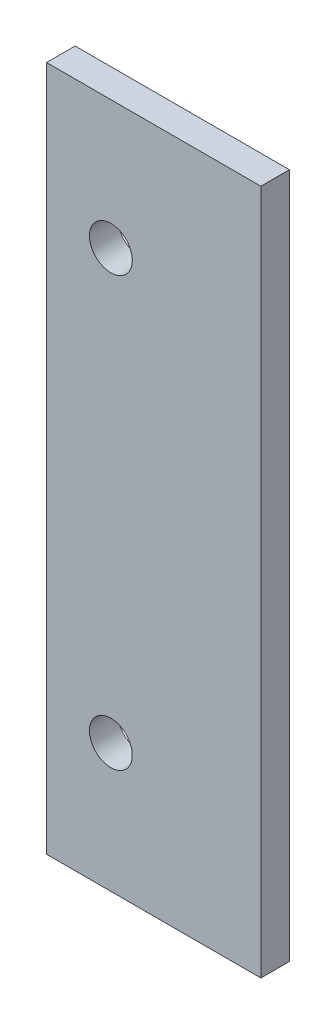
ISO-10303-21;
HEADER;
FILE_DESCRIPTION(('STEP AP214'),'2;1');
FILE_NAME('part.step','',(''),(''),'','','');
FILE_SCHEMA(('AUTOMOTIVE_DESIGN { 1 0 10303 214 1 1 1 1 }'));
ENDSEC;
DATA;
#1=APPLICATION_CONTEXT('core data for automotive mechanical design processes');
#2=APPLICATION_PROTOCOL_DEFINITION('international standard','automotive_design',2000,#1);
#3=PRODUCT_CONTEXT('',#1,'mechanical');
#4=PRODUCT('Part','Part','',(#3));
#5=PRODUCT_RELATED_PRODUCT_CATEGORY('part','',(#4));
#6=PRODUCT_DEFINITION_FORMATION('','',#4);
#7=PRODUCT_DEFINITION_CONTEXT('part definition',#1,'design');
#8=PRODUCT_DEFINITION('design','',#6,#7);
#9=PRODUCT_DEFINITION_SHAPE('','',#8);
#10=(LENGTH_UNIT() NAMED_UNIT(*) SI_UNIT(.MILLI.,.METRE.));
#11=(NAMED_UNIT(*) PLANE_ANGLE_UNIT() SI_UNIT($,.RADIAN.));
#12=(NAMED_UNIT(*) SI_UNIT($,.STERADIAN.) SOLID_ANGLE_UNIT());
#13=UNCERTAINTY_MEASURE_WITH_UNIT(LENGTH_MEASURE(1.E-05),#10,'distance_accuracy_value','');
#14=(GEOMETRIC_REPRESENTATION_CONTEXT(3) GLOBAL_UNCERTAINTY_ASSIGNED_CONTEXT((#13)) GLOBAL_UNIT_ASSIGNED_CONTEXT((#10,
#11,#12)) REPRESENTATION_CONTEXT('',''));
#15=CARTESIAN_POINT('',(0.,0.,0.));
#16=DIRECTION('',(0.,0.,1.));
#17=DIRECTION('',(1.,0.,0.));
#18=AXIS2_PLACEMENT_3D('',#15,#16,#17);
#19=CARTESIAN_POINT('',(0.,0.,2.));
#20=DIRECTION('',(0.,0.,-1.));
#21=DIRECTION('',(-1.,0.,0.));
#22=AXIS2_PLACEMENT_3D('',#19,#20,#21);
#23=PLANE('',#22);
#24=CARTESIAN_POINT('',(4.5,-9.,2.));
#25=DIRECTION('',(0.,0.,1.));
#26=DIRECTION('',(1.,0.,0.));
#27=AXIS2_PLACEMENT_3D('',#24,#25,#26);
#28=CIRCLE('',#27,1.5);
#29=CARTESIAN_POINT('',(6.,-9.,2.));
#30=VERTEX_POINT('',#29);
#31=EDGE_CURVE('E98',#30,#30,#28,.T.);
#32=ORIENTED_EDGE('',*,*,#31,.F.);
#33=EDGE_LOOP('',(#32));
#34=FACE_BOUND('',#33,.T.);
#35=DIRECTION('',(0.,-1.,0.));
#36=VECTOR('',#35,1.);
#37=CARTESIAN_POINT('',(0.,-48.,2.));
#38=LINE('',#37,#36);
#39=CARTESIAN_POINT('',(0.,0.,2.));
#40=VERTEX_POINT('',#39);
#41=CARTESIAN_POINT('',(0.,-48.,2.));
#42=VERTEX_POINT('',#41);
#43=EDGE_CURVE('E83',#40,#42,#38,.T.);
#44=ORIENTED_EDGE('',*,*,#43,.T.);
#45=DIRECTION('',(1.,0.,0.));
#46=VECTOR('',#45,1.);
#47=CARTESIAN_POINT('',(15.,-48.,2.));
#48=LINE('',#47,#46);
#49=CARTESIAN_POINT('',(15.,-48.,2.));
#50=VERTEX_POINT('',#49);
#51=EDGE_CURVE('E78',#42,#50,#48,.T.);
#52=ORIENTED_EDGE('',*,*,#51,.T.);
#53=DIRECTION('',(0.,1.,0.));
#54=VECTOR('',#53,1.);
#55=CARTESIAN_POINT('',(15.,0.,2.));
#56=LINE('',#55,#54);
#57=CARTESIAN_POINT('',(15.,0.,2.));
#58=VERTEX_POINT('',#57);
#59=EDGE_CURVE('E81',#50,#58,#56,.T.);
#60=ORIENTED_EDGE('',*,*,#59,.T.);
#61=DIRECTION('',(-1.,0.,0.));
#62=VECTOR('',#61,1.);
#63=CARTESIAN_POINT('',(0.,0.,2.));
#64=LINE('',#63,#62);
#65=EDGE_CURVE('E48',#58,#40,#64,.T.);
#66=ORIENTED_EDGE('',*,*,#65,.T.);
#67=EDGE_LOOP('',(#44,#52,#60,#66));
#68=FACE_BOUND('',#67,.T.);
#69=CARTESIAN_POINT('',(4.49999999999986,-39.,2.));
#70=DIRECTION('',(0.,0.,1.));
#71=DIRECTION('',(-1.,0.,0.));
#72=AXIS2_PLACEMENT_3D('',#69,#70,#71);
#73=CIRCLE('',#72,1.5);
#74=CARTESIAN_POINT('',(2.99999999999986,-39.,2.));
#75=VERTEX_POINT('',#74);
#76=EDGE_CURVE('E113',#75,#75,#73,.T.);
#77=ORIENTED_EDGE('',*,*,#76,.F.);
#78=EDGE_LOOP('',(#77));
#79=FACE_BOUND('',#78,.T.);
#80=ADVANCED_FACE('F31',(#34,#68,#79),#23,.F.);
#81=CARTESIAN_POINT('',(0.,0.,0.));
#82=DIRECTION('',(0.,0.,-1.));
#83=DIRECTION('',(-1.,0.,0.));
#84=AXIS2_PLACEMENT_3D('',#81,#82,#83);
#85=PLANE('',#84);
#86=CARTESIAN_POINT('',(4.5,-9.,0.));
#87=DIRECTION('',(0.,0.,1.));
#88=DIRECTION('',(1.,0.,0.));
#89=AXIS2_PLACEMENT_3D('',#86,#87,#88);
#90=CIRCLE('',#89,1.5);
#91=CARTESIAN_POINT('',(6.,-9.,0.));
#92=VERTEX_POINT('',#91);
#93=EDGE_CURVE('E110',#92,#92,#90,.T.);
#94=ORIENTED_EDGE('',*,*,#93,.T.);
#95=EDGE_LOOP('',(#94));
#96=FACE_BOUND('',#95,.T.);
#97=DIRECTION('',(0.,-1.,0.));
#98=VECTOR('',#97,1.);
#99=CARTESIAN_POINT('',(0.,-48.,0.));
#100=LINE('',#99,#98);
#101=CARTESIAN_POINT('',(0.,0.,0.));
#102=VERTEX_POINT('',#101);
#103=CARTESIAN_POINT('',(0.,-48.,0.));
#104=VERTEX_POINT('',#103);
#105=EDGE_CURVE('E95',#102,#104,#100,.T.);
#106=ORIENTED_EDGE('',*,*,#105,.F.);
#107=DIRECTION('',(-1.,0.,0.));
#108=VECTOR('',#107,1.);
#109=CARTESIAN_POINT('',(0.,0.,0.));
#110=LINE('',#109,#108);
#111=CARTESIAN_POINT('',(15.,0.,0.));
#112=VERTEX_POINT('',#111);
#113=EDGE_CURVE('E71',#112,#102,#110,.T.);
#114=ORIENTED_EDGE('',*,*,#113,.F.);
#115=DIRECTION('',(0.,1.,0.));
#116=VECTOR('',#115,1.);
#117=CARTESIAN_POINT('',(15.,0.,0.));
#118=LINE('',#117,#116);
#119=CARTESIAN_POINT('',(15.,-48.,0.));
#120=VERTEX_POINT('',#119);
#121=EDGE_CURVE('E65',#120,#112,#118,.T.);
#122=ORIENTED_EDGE('',*,*,#121,.F.);
#123=DIRECTION('',(1.,0.,0.));
#124=VECTOR('',#123,1.);
#125=CARTESIAN_POINT('',(15.,-48.,0.));
#126=LINE('',#125,#124);
#127=EDGE_CURVE('E87',#104,#120,#126,.T.);
#128=ORIENTED_EDGE('',*,*,#127,.F.);
#129=EDGE_LOOP('',(#106,#114,#122,#128));
#130=FACE_BOUND('',#129,.T.);
#131=CARTESIAN_POINT('',(4.49999999999986,-39.,0.));
#132=DIRECTION('',(0.,0.,1.));
#133=DIRECTION('',(-1.,0.,0.));
#134=AXIS2_PLACEMENT_3D('',#131,#132,#133);
#135=CIRCLE('',#134,1.5);
#136=CARTESIAN_POINT('',(2.99999999999986,-39.,0.));
#137=VERTEX_POINT('',#136);
#138=EDGE_CURVE('E116',#137,#137,#135,.T.);
#139=ORIENTED_EDGE('',*,*,#138,.T.);
#140=EDGE_LOOP('',(#139));
#141=FACE_BOUND('',#140,.T.);
#142=ADVANCED_FACE('F106',(#96,#130,#141),#85,.T.);
#143=CARTESIAN_POINT('',(0.,-48.,2.));
#144=DIRECTION('',(1.,0.,0.));
#145=DIRECTION('',(0.,0.,-1.));
#146=AXIS2_PLACEMENT_3D('',#143,#144,#145);
#147=PLANE('',#146);
#148=ORIENTED_EDGE('',*,*,#105,.T.);
#149=DIRECTION('',(0.,0.,-1.));
#150=VECTOR('',#149,1.);
#151=CARTESIAN_POINT('',(0.,-48.,2.));
#152=LINE('',#151,#150);
#153=EDGE_CURVE('E11',#42,#104,#152,.T.);
#154=ORIENTED_EDGE('',*,*,#153,.F.);
#155=ORIENTED_EDGE('',*,*,#43,.F.);
#156=DIRECTION('',(0.,0.,-1.));
#157=VECTOR('',#156,1.);
#158=CARTESIAN_POINT('',(0.,0.,2.));
#159=LINE('',#158,#157);
#160=EDGE_CURVE('E91',#40,#102,#159,.T.);
#161=ORIENTED_EDGE('',*,*,#160,.T.);
#162=EDGE_LOOP('',(#148,#154,#155,#161));
#163=FACE_BOUND('',#162,.T.);
#164=ADVANCED_FACE('F33',(#163),#147,.F.);
#165=CARTESIAN_POINT('',(15.,-48.,2.));
#166=DIRECTION('',(0.,1.,0.));
#167=DIRECTION('',(0.,0.,1.));
#168=AXIS2_PLACEMENT_3D('',#165,#166,#167);
#169=PLANE('',#168);
#170=ORIENTED_EDGE('',*,*,#127,.T.);
#171=DIRECTION('',(0.,0.,-1.));
#172=VECTOR('',#171,1.);
#173=CARTESIAN_POINT('',(15.,-48.,2.));
#174=LINE('',#173,#172);
#175=EDGE_CURVE('E40',#50,#120,#174,.T.);
#176=ORIENTED_EDGE('',*,*,#175,.F.);
#177=ORIENTED_EDGE('',*,*,#51,.F.);
#178=ORIENTED_EDGE('',*,*,#153,.T.);
#179=EDGE_LOOP('',(#170,#176,#177,#178));
#180=FACE_BOUND('',#179,.T.);
#181=ADVANCED_FACE('F86',(#180),#169,.F.);
#182=CARTESIAN_POINT('',(15.,0.,2.));
#183=DIRECTION('',(-1.,0.,0.));
#184=DIRECTION('',(0.,-1.,0.));
#185=AXIS2_PLACEMENT_3D('',#182,#183,#184);
#186=PLANE('',#185);
#187=ORIENTED_EDGE('',*,*,#121,.T.);
#188=DIRECTION('',(0.,0.,-1.));
#189=VECTOR('',#188,1.);
#190=CARTESIAN_POINT('',(15.,0.,2.));
#191=LINE('',#190,#189);
#192=EDGE_CURVE('E88',#58,#112,#191,.T.);
#193=ORIENTED_EDGE('',*,*,#192,.F.);
#194=ORIENTED_EDGE('',*,*,#59,.F.);
#195=ORIENTED_EDGE('',*,*,#175,.T.);
#196=EDGE_LOOP('',(#187,#193,#194,#195));
#197=FACE_BOUND('',#196,.T.);
#198=ADVANCED_FACE('F89',(#197),#186,.F.);
#199=CARTESIAN_POINT('',(0.,0.,2.));
#200=DIRECTION('',(0.,-1.,0.));
#201=DIRECTION('',(0.,0.,-1.));
#202=AXIS2_PLACEMENT_3D('',#199,#200,#201);
#203=PLANE('',#202);
#204=ORIENTED_EDGE('',*,*,#113,.T.);
#205=ORIENTED_EDGE('',*,*,#160,.F.);
#206=ORIENTED_EDGE('',*,*,#65,.F.);
#207=ORIENTED_EDGE('',*,*,#192,.T.);
#208=EDGE_LOOP('',(#204,#205,#206,#207));
#209=FACE_BOUND('',#208,.T.);
#210=ADVANCED_FACE('F103',(#209),#203,.F.);
#211=CARTESIAN_POINT('',(4.5,-9.,2.));
#212=DIRECTION('',(0.,0.,-1.));
#213=DIRECTION('',(-1.,0.,0.));
#214=AXIS2_PLACEMENT_3D('',#211,#212,#213);
#215=CYLINDRICAL_SURFACE('',#214,1.5);
#216=ORIENTED_EDGE('',*,*,#31,.T.);
#217=EDGE_LOOP('',(#216));
#218=FACE_BOUND('',#217,.T.);
#219=ORIENTED_EDGE('',*,*,#93,.F.);
#220=EDGE_LOOP('',(#219));
#221=FACE_BOUND('',#220,.T.);
#222=ADVANCED_FACE('F134',(#218,#221),#215,.F.);
#223=CARTESIAN_POINT('',(4.49999999999986,-39.,2.));
#224=DIRECTION('',(0.,0.,-1.));
#225=DIRECTION('',(-1.,0.,0.));
#226=AXIS2_PLACEMENT_3D('',#223,#224,#225);
#227=CYLINDRICAL_SURFACE('',#226,1.5);
#228=ORIENTED_EDGE('',*,*,#76,.T.);
#229=EDGE_LOOP('',(#228));
#230=FACE_BOUND('',#229,.T.);
#231=ORIENTED_EDGE('',*,*,#138,.F.);
#232=EDGE_LOOP('',(#231));
#233=FACE_BOUND('',#232,.T.);
#234=ADVANCED_FACE('F122',(#230,#233),#227,.F.);
#235=CLOSED_SHELL('',(#80,#142,#164,#181,#198,#210,#222,#234));
#236=MANIFOLD_SOLID_BREP('B2',#235);
#237=ADVANCED_BREP_SHAPE_REPRESENTATION('',(#18,#236),#14);
#238=SHAPE_DEFINITION_REPRESENTATION(#9,#237);
ENDSEC;
END-ISO-10303-21;
